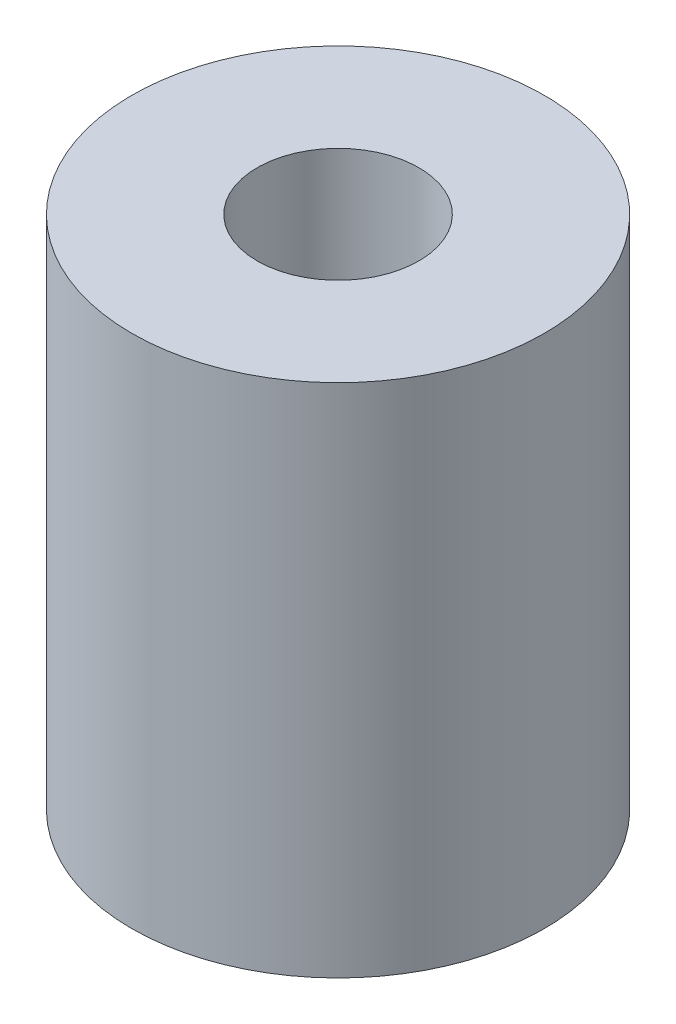
ISO-10303-21;
HEADER;
FILE_DESCRIPTION(('STEP AP214'),'2;1');
FILE_NAME('part.step','',(''),(''),'','','');
FILE_SCHEMA(('AUTOMOTIVE_DESIGN { 1 0 10303 214 1 1 1 1 }'));
ENDSEC;
DATA;
#1=APPLICATION_CONTEXT('core data for automotive mechanical design processes');
#2=APPLICATION_PROTOCOL_DEFINITION('international standard','automotive_design',2000,#1);
#3=PRODUCT_CONTEXT('',#1,'mechanical');
#4=PRODUCT('Part','Part','',(#3));
#5=PRODUCT_RELATED_PRODUCT_CATEGORY('part','',(#4));
#6=PRODUCT_DEFINITION_FORMATION('','',#4);
#7=PRODUCT_DEFINITION_CONTEXT('part definition',#1,'design');
#8=PRODUCT_DEFINITION('design','',#6,#7);
#9=PRODUCT_DEFINITION_SHAPE('','',#8);
#10=(LENGTH_UNIT() NAMED_UNIT(*) SI_UNIT(.MILLI.,.METRE.));
#11=(NAMED_UNIT(*) PLANE_ANGLE_UNIT() SI_UNIT($,.RADIAN.));
#12=(NAMED_UNIT(*) SI_UNIT($,.STERADIAN.) SOLID_ANGLE_UNIT());
#13=UNCERTAINTY_MEASURE_WITH_UNIT(LENGTH_MEASURE(1.E-05),#10,'distance_accuracy_value','');
#14=(GEOMETRIC_REPRESENTATION_CONTEXT(3) GLOBAL_UNCERTAINTY_ASSIGNED_CONTEXT((#13)) GLOBAL_UNIT_ASSIGNED_CONTEXT((#10,
#11,#12)) REPRESENTATION_CONTEXT('',''));
#15=CARTESIAN_POINT('',(0.,0.,0.));
#16=DIRECTION('',(0.,0.,1.));
#17=DIRECTION('',(1.,0.,0.));
#18=AXIS2_PLACEMENT_3D('',#15,#16,#17);
#19=CARTESIAN_POINT('',(0.,15.875,0.));
#20=DIRECTION('',(0.,1.,0.));
#21=DIRECTION('',(0.,0.,1.));
#22=AXIS2_PLACEMENT_3D('',#19,#20,#21);
#23=PLANE('',#22);
#24=CARTESIAN_POINT('',(0.,15.875,0.));
#25=DIRECTION('',(0.,1.,0.));
#26=DIRECTION('',(0.,0.,1.));
#27=AXIS2_PLACEMENT_3D('',#24,#25,#26);
#28=CIRCLE('',#27,6.35);
#29=CARTESIAN_POINT('',(0.,15.875,6.35));
#30=VERTEX_POINT('',#29);
#31=EDGE_CURVE('E10',#30,#30,#28,.T.);
#32=ORIENTED_EDGE('',*,*,#31,.T.);
#33=EDGE_LOOP('',(#32));
#34=FACE_BOUND('',#33,.T.);
#35=CARTESIAN_POINT('',(0.,15.875,0.));
#36=DIRECTION('',(0.,1.,0.));
#37=DIRECTION('',(0.,0.,1.));
#38=AXIS2_PLACEMENT_3D('',#35,#36,#37);
#39=CIRCLE('',#38,2.4892);
#40=CARTESIAN_POINT('',(0.,15.875,2.4892));
#41=VERTEX_POINT('',#40);
#42=EDGE_CURVE('E41',#41,#41,#39,.T.);
#43=ORIENTED_EDGE('',*,*,#42,.F.);
#44=EDGE_LOOP('',(#43));
#45=FACE_BOUND('',#44,.T.);
#46=ADVANCED_FACE('F30',(#34,#45),#23,.T.);
#47=CARTESIAN_POINT('',(0.,0.,0.));
#48=DIRECTION('',(0.,1.,0.));
#49=DIRECTION('',(0.,0.,1.));
#50=AXIS2_PLACEMENT_3D('',#47,#48,#49);
#51=PLANE('',#50);
#52=CARTESIAN_POINT('',(0.,0.,0.));
#53=DIRECTION('',(0.,1.,0.));
#54=DIRECTION('',(0.,0.,1.));
#55=AXIS2_PLACEMENT_3D('',#52,#53,#54);
#56=CIRCLE('',#55,6.35);
#57=CARTESIAN_POINT('',(0.,0.,6.35));
#58=VERTEX_POINT('',#57);
#59=EDGE_CURVE('E34',#58,#58,#56,.T.);
#60=ORIENTED_EDGE('',*,*,#59,.F.);
#61=EDGE_LOOP('',(#60));
#62=FACE_BOUND('',#61,.T.);
#63=CARTESIAN_POINT('',(0.,0.,0.));
#64=DIRECTION('',(0.,1.,0.));
#65=DIRECTION('',(0.,0.,1.));
#66=AXIS2_PLACEMENT_3D('',#63,#64,#65);
#67=CIRCLE('',#66,2.4892);
#68=CARTESIAN_POINT('',(0.,0.,2.4892));
#69=VERTEX_POINT('',#68);
#70=EDGE_CURVE('E43',#69,#69,#67,.T.);
#71=ORIENTED_EDGE('',*,*,#70,.T.);
#72=EDGE_LOOP('',(#71));
#73=FACE_BOUND('',#72,.T.);
#74=ADVANCED_FACE('F53',(#62,#73),#51,.F.);
#75=CARTESIAN_POINT('',(0.,15.875,0.));
#76=DIRECTION('',(0.,-1.,0.));
#77=DIRECTION('',(0.,0.,-1.));
#78=AXIS2_PLACEMENT_3D('',#75,#76,#77);
#79=CYLINDRICAL_SURFACE('',#78,6.35);
#80=ORIENTED_EDGE('',*,*,#31,.F.);
#81=EDGE_LOOP('',(#80));
#82=FACE_BOUND('',#81,.T.);
#83=ORIENTED_EDGE('',*,*,#59,.T.);
#84=EDGE_LOOP('',(#83));
#85=FACE_BOUND('',#84,.T.);
#86=ADVANCED_FACE('F32',(#82,#85),#79,.T.);
#87=CARTESIAN_POINT('',(0.,15.875,0.));
#88=DIRECTION('',(0.,-1.,0.));
#89=DIRECTION('',(0.,0.,-1.));
#90=AXIS2_PLACEMENT_3D('',#87,#88,#89);
#91=CYLINDRICAL_SURFACE('',#90,2.4892);
#92=ORIENTED_EDGE('',*,*,#42,.T.);
#93=EDGE_LOOP('',(#92));
#94=FACE_BOUND('',#93,.T.);
#95=ORIENTED_EDGE('',*,*,#70,.F.);
#96=EDGE_LOOP('',(#95));
#97=FACE_BOUND('',#96,.T.);
#98=ADVANCED_FACE('F49',(#94,#97),#91,.F.);
#99=CLOSED_SHELL('',(#46,#74,#86,#98));
#100=MANIFOLD_SOLID_BREP('B2',#99);
#101=ADVANCED_BREP_SHAPE_REPRESENTATION('',(#18,#100),#14);
#102=SHAPE_DEFINITION_REPRESENTATION(#9,#101);
ENDSEC;
END-ISO-10303-21;
